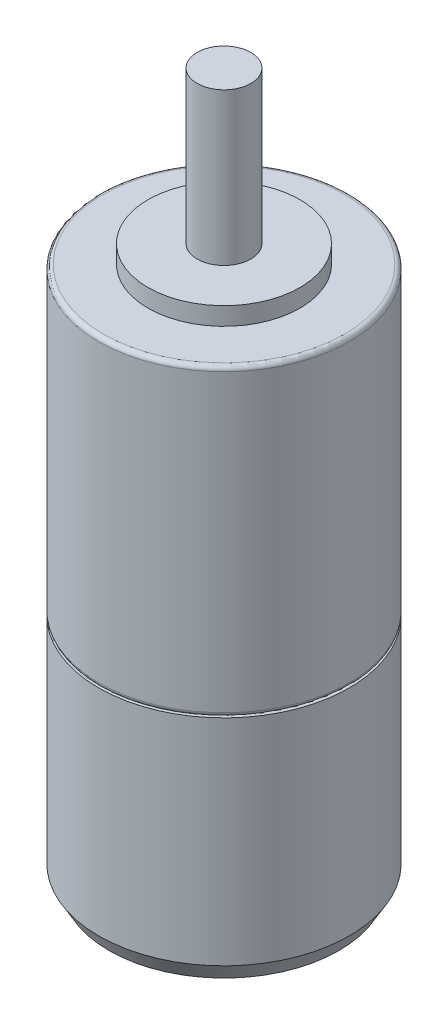
ISO-10303-21;
HEADER;
FILE_DESCRIPTION(('STEP AP214'),'2;1');
FILE_NAME('part.step','',(''),(''),'','','');
FILE_SCHEMA(('AUTOMOTIVE_DESIGN { 1 0 10303 214 1 1 1 1 }'));
ENDSEC;
DATA;
#1=APPLICATION_CONTEXT('core data for automotive mechanical design processes');
#2=APPLICATION_PROTOCOL_DEFINITION('international standard','automotive_design',2000,#1);
#3=PRODUCT_CONTEXT('',#1,'mechanical');
#4=PRODUCT('Part','Part','',(#3));
#5=PRODUCT_RELATED_PRODUCT_CATEGORY('part','',(#4));
#6=PRODUCT_DEFINITION_FORMATION('','',#4);
#7=PRODUCT_DEFINITION_CONTEXT('part definition',#1,'design');
#8=PRODUCT_DEFINITION('design','',#6,#7);
#9=PRODUCT_DEFINITION_SHAPE('','',#8);
#10=(LENGTH_UNIT() NAMED_UNIT(*) SI_UNIT(.MILLI.,.METRE.));
#11=(NAMED_UNIT(*) PLANE_ANGLE_UNIT() SI_UNIT($,.RADIAN.));
#12=(NAMED_UNIT(*) SI_UNIT($,.STERADIAN.) SOLID_ANGLE_UNIT());
#13=UNCERTAINTY_MEASURE_WITH_UNIT(LENGTH_MEASURE(1.E-05),#10,'distance_accuracy_value','');
#14=(GEOMETRIC_REPRESENTATION_CONTEXT(3) GLOBAL_UNCERTAINTY_ASSIGNED_CONTEXT((#13)) GLOBAL_UNIT_ASSIGNED_CONTEXT((#10,
#11,#12)) REPRESENTATION_CONTEXT('',''));
#15=CARTESIAN_POINT('',(0.,0.,0.));
#16=DIRECTION('',(0.,0.,1.));
#17=DIRECTION('',(1.,0.,0.));
#18=AXIS2_PLACEMENT_3D('',#15,#16,#17);
#19=CARTESIAN_POINT('',(0.,34.,0.));
#20=DIRECTION('',(0.,-1.,0.));
#21=DIRECTION('',(0.,0.,-1.));
#22=AXIS2_PLACEMENT_3D('',#19,#20,#21);
#23=CYLINDRICAL_SURFACE('',#22,14.);
#24=CARTESIAN_POINT('',(0.,0.5,0.));
#25=DIRECTION('',(0.,1.,0.));
#26=DIRECTION('',(0.,0.,1.));
#27=AXIS2_PLACEMENT_3D('',#24,#25,#26);
#28=CIRCLE('',#27,14.);
#29=CARTESIAN_POINT('',(0.,0.5,14.));
#30=VERTEX_POINT('',#29);
#31=EDGE_CURVE('E60',#30,#30,#28,.T.);
#32=ORIENTED_EDGE('',*,*,#31,.T.);
#33=EDGE_LOOP('',(#32));
#34=FACE_BOUND('',#33,.T.);
#35=CARTESIAN_POINT('',(0.,33.5,0.));
#36=DIRECTION('',(0.,1.,0.));
#37=DIRECTION('',(0.,0.,1.));
#38=AXIS2_PLACEMENT_3D('',#35,#36,#37);
#39=CIRCLE('',#38,14.);
#40=CARTESIAN_POINT('',(0.,33.5,14.));
#41=VERTEX_POINT('',#40);
#42=EDGE_CURVE('E63',#41,#41,#39,.F.);
#43=ORIENTED_EDGE('',*,*,#42,.T.);
#44=EDGE_LOOP('',(#43));
#45=FACE_BOUND('',#44,.T.);
#46=ADVANCED_FACE('F39',(#34,#45),#23,.T.);
#47=CARTESIAN_POINT('',(0.,34.,0.));
#48=DIRECTION('',(0.,1.,0.));
#49=DIRECTION('',(0.,0.,1.));
#50=AXIS2_PLACEMENT_3D('',#47,#48,#49);
#51=PLANE('',#50);
#52=CARTESIAN_POINT('',(0.,34.,0.));
#53=DIRECTION('',(0.,1.,0.));
#54=DIRECTION('',(0.,0.,1.));
#55=AXIS2_PLACEMENT_3D('',#52,#53,#54);
#56=CIRCLE('',#55,13.5);
#57=CARTESIAN_POINT('',(0.,34.,13.5));
#58=VERTEX_POINT('',#57);
#59=EDGE_CURVE('E51',#58,#58,#56,.T.);
#60=ORIENTED_EDGE('',*,*,#59,.T.);
#61=EDGE_LOOP('',(#60));
#62=FACE_BOUND('',#61,.T.);
#63=CARTESIAN_POINT('',(0.,34.,0.));
#64=DIRECTION('',(0.,1.,0.));
#65=DIRECTION('',(0.,0.,1.));
#66=AXIS2_PLACEMENT_3D('',#63,#64,#65);
#67=CIRCLE('',#66,8.5);
#68=CARTESIAN_POINT('',(0.,34.,8.5));
#69=VERTEX_POINT('',#68);
#70=EDGE_CURVE('E67',#69,#69,#67,.T.);
#71=ORIENTED_EDGE('',*,*,#70,.F.);
#72=EDGE_LOOP('',(#71));
#73=FACE_BOUND('',#72,.T.);
#74=ADVANCED_FACE('F110',(#62,#73),#51,.T.);
#75=CARTESIAN_POINT('',(0.,36.,0.));
#76=DIRECTION('',(0.,-1.,0.));
#77=DIRECTION('',(0.,0.,-1.));
#78=AXIS2_PLACEMENT_3D('',#75,#76,#77);
#79=CYLINDRICAL_SURFACE('',#78,8.5);
#80=CARTESIAN_POINT('',(0.,36.,0.));
#81=DIRECTION('',(0.,1.,0.));
#82=DIRECTION('',(0.,0.,1.));
#83=AXIS2_PLACEMENT_3D('',#80,#81,#82);
#84=CIRCLE('',#83,8.5);
#85=CARTESIAN_POINT('',(0.,36.,8.5));
#86=VERTEX_POINT('',#85);
#87=EDGE_CURVE('E70',#86,#86,#84,.T.);
#88=ORIENTED_EDGE('',*,*,#87,.F.);
#89=EDGE_LOOP('',(#88));
#90=FACE_BOUND('',#89,.T.);
#91=ORIENTED_EDGE('',*,*,#70,.T.);
#92=EDGE_LOOP('',(#91));
#93=FACE_BOUND('',#92,.T.);
#94=ADVANCED_FACE('F116',(#90,#93),#79,.T.);
#95=CARTESIAN_POINT('',(0.,36.,0.));
#96=DIRECTION('',(0.,1.,0.));
#97=DIRECTION('',(0.,0.,1.));
#98=AXIS2_PLACEMENT_3D('',#95,#96,#97);
#99=PLANE('',#98);
#100=CARTESIAN_POINT('',(0.,36.,0.));
#101=DIRECTION('',(0.,1.,0.));
#102=DIRECTION('',(0.,0.,1.));
#103=AXIS2_PLACEMENT_3D('',#100,#101,#102);
#104=CIRCLE('',#103,3.);
#105=CARTESIAN_POINT('',(0.,36.,3.));
#106=VERTEX_POINT('',#105);
#107=EDGE_CURVE('E66',#106,#106,#104,.T.);
#108=ORIENTED_EDGE('',*,*,#107,.F.);
#109=EDGE_LOOP('',(#108));
#110=FACE_BOUND('',#109,.T.);
#111=ORIENTED_EDGE('',*,*,#87,.T.);
#112=EDGE_LOOP('',(#111));
#113=FACE_BOUND('',#112,.T.);
#114=ADVANCED_FACE('F137',(#110,#113),#99,.T.);
#115=CARTESIAN_POINT('',(0.,53.,0.));
#116=DIRECTION('',(0.,-1.,0.));
#117=DIRECTION('',(0.,0.,-1.));
#118=AXIS2_PLACEMENT_3D('',#115,#116,#117);
#119=CYLINDRICAL_SURFACE('',#118,3.);
#120=CARTESIAN_POINT('',(0.,53.,0.));
#121=DIRECTION('',(0.,1.,0.));
#122=DIRECTION('',(0.,0.,1.));
#123=AXIS2_PLACEMENT_3D('',#120,#121,#122);
#124=CIRCLE('',#123,3.);
#125=CARTESIAN_POINT('',(0.,53.,3.));
#126=VERTEX_POINT('',#125);
#127=EDGE_CURVE('E73',#126,#126,#124,.T.);
#128=ORIENTED_EDGE('',*,*,#127,.F.);
#129=EDGE_LOOP('',(#128));
#130=FACE_BOUND('',#129,.T.);
#131=ORIENTED_EDGE('',*,*,#107,.T.);
#132=EDGE_LOOP('',(#131));
#133=FACE_BOUND('',#132,.T.);
#134=ADVANCED_FACE('F142',(#130,#133),#119,.T.);
#135=CARTESIAN_POINT('',(0.,53.,0.));
#136=DIRECTION('',(0.,1.,0.));
#137=DIRECTION('',(0.,0.,1.));
#138=AXIS2_PLACEMENT_3D('',#135,#136,#137);
#139=PLANE('',#138);
#140=ORIENTED_EDGE('',*,*,#127,.T.);
#141=EDGE_LOOP('',(#140));
#142=FACE_BOUND('',#141,.T.);
#143=ADVANCED_FACE('F124',(#142),#139,.T.);
#144=CARTESIAN_POINT('',(0.,0.5,0.));
#145=DIRECTION('',(0.,1.,0.));
#146=DIRECTION('',(0.,0.,1.));
#147=AXIS2_PLACEMENT_3D('',#144,#145,#146);
#148=TOROIDAL_SURFACE('',#147,13.5,0.5);
#149=CARTESIAN_POINT('',(0.,0.,0.));
#150=DIRECTION('',(0.,1.,0.));
#151=DIRECTION('',(0.,0.,1.));
#152=AXIS2_PLACEMENT_3D('',#149,#150,#151);
#153=CIRCLE('',#152,13.5);
#154=CARTESIAN_POINT('',(0.,0.,13.5));
#155=VERTEX_POINT('',#154);
#156=EDGE_CURVE('E55',#155,#155,#153,.F.);
#157=ORIENTED_EDGE('',*,*,#156,.F.);
#158=EDGE_LOOP('',(#157));
#159=FACE_BOUND('',#158,.T.);
#160=ORIENTED_EDGE('',*,*,#31,.F.);
#161=EDGE_LOOP('',(#160));
#162=FACE_BOUND('',#161,.T.);
#163=ADVANCED_FACE('F122',(#159,#162),#148,.T.);
#164=CARTESIAN_POINT('',(0.,33.5,0.));
#165=DIRECTION('',(0.,1.,0.));
#166=DIRECTION('',(0.,0.,1.));
#167=AXIS2_PLACEMENT_3D('',#164,#165,#166);
#168=TOROIDAL_SURFACE('',#167,13.5,0.5);
#169=ORIENTED_EDGE('',*,*,#42,.F.);
#170=EDGE_LOOP('',(#169));
#171=FACE_BOUND('',#170,.T.);
#172=ORIENTED_EDGE('',*,*,#59,.F.);
#173=EDGE_LOOP('',(#172));
#174=FACE_BOUND('',#173,.T.);
#175=ADVANCED_FACE('F107',(#171,#174),#168,.T.);
#176=CARTESIAN_POINT('',(0.,-26.,0.));
#177=DIRECTION('',(0.,1.,0.));
#178=DIRECTION('',(0.,0.,1.));
#179=AXIS2_PLACEMENT_3D('',#176,#177,#178);
#180=CYLINDRICAL_SURFACE('',#179,14.);
#181=CARTESIAN_POINT('',(0.,-24.0000000000001,0.));
#182=DIRECTION('',(0.,-1.,0.));
#183=DIRECTION('',(0.,0.,-1.));
#184=AXIS2_PLACEMENT_3D('',#181,#182,#183);
#185=CIRCLE('',#184,14.);
#186=CARTESIAN_POINT('',(0.,-24.0000000000001,-14.));
#187=VERTEX_POINT('',#186);
#188=EDGE_CURVE('E10',#187,#187,#185,.F.);
#189=ORIENTED_EDGE('',*,*,#188,.T.);
#190=EDGE_LOOP('',(#189));
#191=FACE_BOUND('',#190,.T.);
#192=CARTESIAN_POINT('',(0.,0.,0.));
#193=DIRECTION('',(0.,-1.,0.));
#194=DIRECTION('',(0.,0.,-1.));
#195=AXIS2_PLACEMENT_3D('',#192,#193,#194);
#196=CIRCLE('',#195,14.);
#197=CARTESIAN_POINT('',(0.,0.,-14.));
#198=VERTEX_POINT('',#197);
#199=EDGE_CURVE('E78',#198,#198,#196,.T.);
#200=ORIENTED_EDGE('',*,*,#199,.T.);
#201=EDGE_LOOP('',(#200));
#202=FACE_BOUND('',#201,.T.);
#203=ADVANCED_FACE('F99',(#191,#202),#180,.T.);
#204=CARTESIAN_POINT('',(0.,-26.,0.));
#205=DIRECTION('',(0.,-1.,0.));
#206=DIRECTION('',(0.,0.,-1.));
#207=AXIS2_PLACEMENT_3D('',#204,#205,#206);
#208=PLANE('',#207);
#209=CARTESIAN_POINT('',(0.,-26.,0.));
#210=DIRECTION('',(0.,-1.,0.));
#211=DIRECTION('',(0.,0.,-1.));
#212=AXIS2_PLACEMENT_3D('',#209,#210,#211);
#213=CIRCLE('',#212,6.);
#214=CARTESIAN_POINT('',(0.,-26.,-6.));
#215=VERTEX_POINT('',#214);
#216=EDGE_CURVE('E82',#215,#215,#213,.T.);
#217=ORIENTED_EDGE('',*,*,#216,.F.);
#218=EDGE_LOOP('',(#217));
#219=FACE_BOUND('',#218,.T.);
#220=CARTESIAN_POINT('',(0.,-26.,0.));
#221=DIRECTION('',(0.,-1.,0.));
#222=DIRECTION('',(0.,0.,-1.));
#223=AXIS2_PLACEMENT_3D('',#220,#221,#222);
#224=CIRCLE('',#223,12.8452994616208);
#225=CARTESIAN_POINT('',(0.,-26.,-12.8452994616208));
#226=VERTEX_POINT('',#225);
#227=EDGE_CURVE('E47',#226,#226,#224,.T.);
#228=ORIENTED_EDGE('',*,*,#227,.T.);
#229=EDGE_LOOP('',(#228));
#230=FACE_BOUND('',#229,.T.);
#231=ADVANCED_FACE('F96',(#219,#230),#208,.T.);
#232=CARTESIAN_POINT('',(0.,0.,0.));
#233=DIRECTION('',(0.,-1.,0.));
#234=DIRECTION('',(0.,0.,-1.));
#235=AXIS2_PLACEMENT_3D('',#232,#233,#234);
#236=PLANE('',#235);
#237=ORIENTED_EDGE('',*,*,#156,.T.);
#238=EDGE_LOOP('',(#237));
#239=FACE_BOUND('',#238,.T.);
#240=ORIENTED_EDGE('',*,*,#199,.F.);
#241=EDGE_LOOP('',(#240));
#242=FACE_BOUND('',#241,.T.);
#243=ADVANCED_FACE('F98',(#239,#242),#236,.F.);
#244=CARTESIAN_POINT('',(0.,-26.,0.));
#245=DIRECTION('',(0.,1.,0.));
#246=DIRECTION('',(0.,0.,1.));
#247=AXIS2_PLACEMENT_3D('',#244,#245,#246);
#248=CONICAL_SURFACE('',#247,12.8452994616208,0.523598775598298);
#249=ORIENTED_EDGE('',*,*,#188,.F.);
#250=EDGE_LOOP('',(#249));
#251=FACE_BOUND('',#250,.T.);
#252=ORIENTED_EDGE('',*,*,#227,.F.);
#253=EDGE_LOOP('',(#252));
#254=FACE_BOUND('',#253,.T.);
#255=ADVANCED_FACE('F42',(#251,#254),#248,.T.);
#256=CARTESIAN_POINT('',(0.,31.,0.));
#257=DIRECTION('',(0.,-1.,0.));
#258=DIRECTION('',(0.,0.,-1.));
#259=AXIS2_PLACEMENT_3D('',#256,#257,#258);
#260=CYLINDRICAL_SURFACE('',#259,6.);
#261=CARTESIAN_POINT('',(0.,31.,0.));
#262=DIRECTION('',(0.,-1.,0.));
#263=DIRECTION('',(0.,0.,-1.));
#264=AXIS2_PLACEMENT_3D('',#261,#262,#263);
#265=CIRCLE('',#264,6.);
#266=CARTESIAN_POINT('',(0.,31.,-6.));
#267=VERTEX_POINT('',#266);
#268=EDGE_CURVE('E81',#267,#267,#265,.T.);
#269=ORIENTED_EDGE('',*,*,#268,.F.);
#270=EDGE_LOOP('',(#269));
#271=FACE_BOUND('',#270,.T.);
#272=ORIENTED_EDGE('',*,*,#216,.T.);
#273=EDGE_LOOP('',(#272));
#274=FACE_BOUND('',#273,.T.);
#275=ADVANCED_FACE('F90',(#271,#274),#260,.F.);
#276=CARTESIAN_POINT('',(0.,31.,0.));
#277=DIRECTION('',(0.,-1.,0.));
#278=DIRECTION('',(0.,0.,-1.));
#279=AXIS2_PLACEMENT_3D('',#276,#277,#278);
#280=PLANE('',#279);
#281=ORIENTED_EDGE('',*,*,#268,.T.);
#282=EDGE_LOOP('',(#281));
#283=FACE_BOUND('',#282,.T.);
#284=ADVANCED_FACE('F88',(#283),#280,.T.);
#285=CLOSED_SHELL('',(#46,#74,#94,#114,#134,#143,#163,#175,#203,#231,#243,#255,#275,#284));
#286=MANIFOLD_SOLID_BREP('B2',#285);
#287=ADVANCED_BREP_SHAPE_REPRESENTATION('',(#18,#286),#14);
#288=SHAPE_DEFINITION_REPRESENTATION(#9,#287);
ENDSEC;
END-ISO-10303-21;
